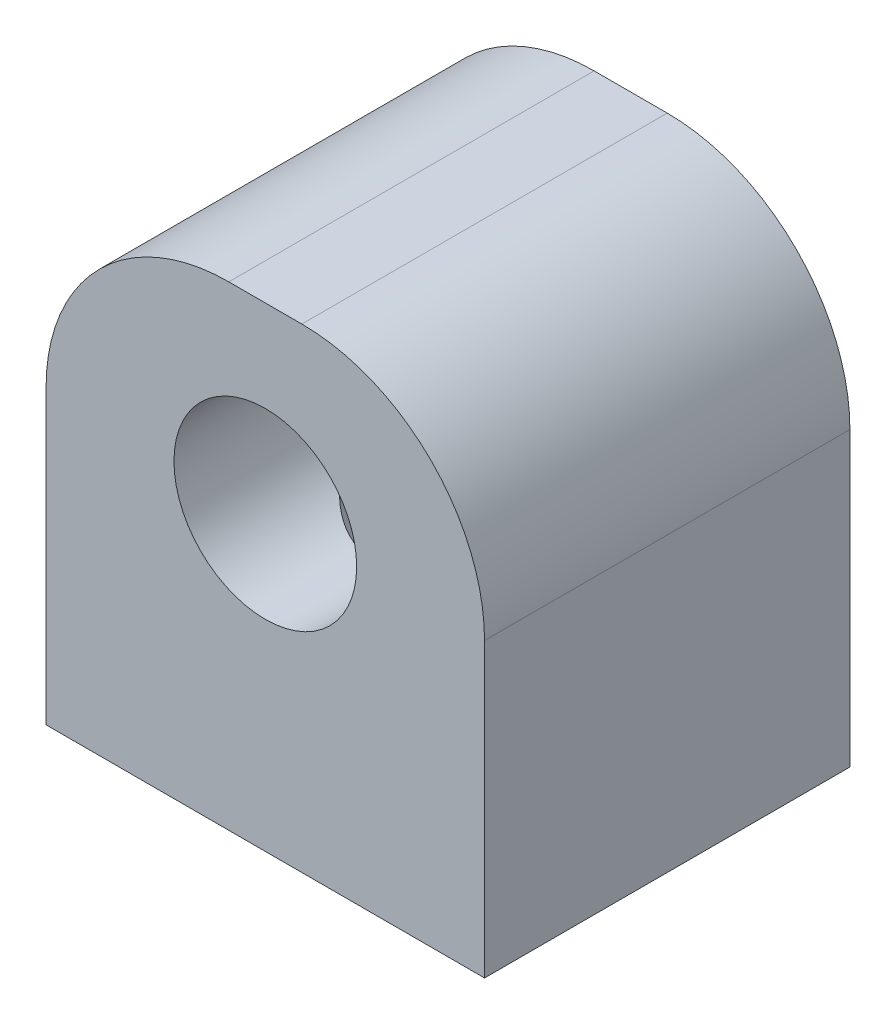
ISO-10303-21;
HEADER;
FILE_DESCRIPTION(('STEP AP214'),'2;1');
FILE_NAME('part.step','',(''),(''),'','','');
FILE_SCHEMA(('AUTOMOTIVE_DESIGN { 1 0 10303 214 1 1 1 1 }'));
ENDSEC;
DATA;
#1=APPLICATION_CONTEXT('core data for automotive mechanical design processes');
#2=APPLICATION_PROTOCOL_DEFINITION('international standard','automotive_design',2000,#1);
#3=PRODUCT_CONTEXT('',#1,'mechanical');
#4=PRODUCT('Part','Part','',(#3));
#5=PRODUCT_RELATED_PRODUCT_CATEGORY('part','',(#4));
#6=PRODUCT_DEFINITION_FORMATION('','',#4);
#7=PRODUCT_DEFINITION_CONTEXT('part definition',#1,'design');
#8=PRODUCT_DEFINITION('design','',#6,#7);
#9=PRODUCT_DEFINITION_SHAPE('','',#8);
#10=(LENGTH_UNIT() NAMED_UNIT(*) SI_UNIT(.MILLI.,.METRE.));
#11=(NAMED_UNIT(*) PLANE_ANGLE_UNIT() SI_UNIT($,.RADIAN.));
#12=(NAMED_UNIT(*) SI_UNIT($,.STERADIAN.) SOLID_ANGLE_UNIT());
#13=UNCERTAINTY_MEASURE_WITH_UNIT(LENGTH_MEASURE(1.E-05),#10,'distance_accuracy_value','');
#14=(GEOMETRIC_REPRESENTATION_CONTEXT(3) GLOBAL_UNCERTAINTY_ASSIGNED_CONTEXT((#13)) GLOBAL_UNIT_ASSIGNED_CONTEXT((#10,
#11,#12)) REPRESENTATION_CONTEXT('',''));
#15=CARTESIAN_POINT('',(0.,0.,0.));
#16=DIRECTION('',(0.,0.,1.));
#17=DIRECTION('',(1.,0.,0.));
#18=AXIS2_PLACEMENT_3D('',#15,#16,#17);
#19=CARTESIAN_POINT('',(6.,-8.,10.));
#20=DIRECTION('',(0.,-1.,0.));
#21=DIRECTION('',(0.,0.,-1.));
#22=AXIS2_PLACEMENT_3D('',#19,#20,#21);
#23=PLANE('',#22);
#24=CARTESIAN_POINT('',(0.,-8.,5.));
#25=DIRECTION('',(0.,-1.,0.));
#26=DIRECTION('',(0.,0.,-1.));
#27=AXIS2_PLACEMENT_3D('',#24,#25,#26);
#28=CIRCLE('',#27,2.1);
#29=CARTESIAN_POINT('',(0.,-8.,2.9));
#30=VERTEX_POINT('',#29);
#31=EDGE_CURVE('E184',#30,#30,#28,.T.);
#32=ORIENTED_EDGE('',*,*,#31,.F.);
#33=EDGE_LOOP('',(#32));
#34=FACE_BOUND('',#33,.T.);
#35=DIRECTION('',(-1.,0.,0.));
#36=VECTOR('',#35,1.);
#37=CARTESIAN_POINT('',(6.,-8.,0.));
#38=LINE('',#37,#36);
#39=CARTESIAN_POINT('',(6.,-8.,0.));
#40=VERTEX_POINT('',#39);
#41=CARTESIAN_POINT('',(-6.,-8.,0.));
#42=VERTEX_POINT('',#41);
#43=EDGE_CURVE('E119',#40,#42,#38,.T.);
#44=ORIENTED_EDGE('',*,*,#43,.F.);
#45=DIRECTION('',(0.,0.,-1.));
#46=VECTOR('',#45,1.);
#47=CARTESIAN_POINT('',(6.,-8.,10.));
#48=LINE('',#47,#46);
#49=CARTESIAN_POINT('',(6.,-8.,10.));
#50=VERTEX_POINT('',#49);
#51=EDGE_CURVE('E98',#50,#40,#48,.T.);
#52=ORIENTED_EDGE('',*,*,#51,.F.);
#53=DIRECTION('',(-1.,0.,0.));
#54=VECTOR('',#53,1.);
#55=CARTESIAN_POINT('',(6.,-8.,10.));
#56=LINE('',#55,#54);
#57=CARTESIAN_POINT('',(-6.,-8.,10.));
#58=VERTEX_POINT('',#57);
#59=EDGE_CURVE('E103',#50,#58,#56,.T.);
#60=ORIENTED_EDGE('',*,*,#59,.T.);
#61=DIRECTION('',(0.,0.,-1.));
#62=VECTOR('',#61,1.);
#63=CARTESIAN_POINT('',(-6.,-8.,10.));
#64=LINE('',#63,#62);
#65=EDGE_CURVE('E86',#58,#42,#64,.T.);
#66=ORIENTED_EDGE('',*,*,#65,.T.);
#67=EDGE_LOOP('',(#44,#52,#60,#66));
#68=FACE_BOUND('',#67,.T.);
#69=ADVANCED_FACE('F33',(#34,#68),#23,.T.);
#70=CARTESIAN_POINT('',(6.,5.,10.));
#71=DIRECTION('',(1.,0.,0.));
#72=DIRECTION('',(0.,0.,-1.));
#73=AXIS2_PLACEMENT_3D('',#70,#71,#72);
#74=PLANE('',#73);
#75=DIRECTION('',(0.,-1.,0.));
#76=VECTOR('',#75,1.);
#77=CARTESIAN_POINT('',(6.,5.,0.));
#78=LINE('',#77,#76);
#79=CARTESIAN_POINT('',(6.,0.,0.));
#80=VERTEX_POINT('',#79);
#81=EDGE_CURVE('E109',#80,#40,#78,.T.);
#82=ORIENTED_EDGE('',*,*,#81,.F.);
#83=DIRECTION('',(0.,0.,-1.));
#84=VECTOR('',#83,1.);
#85=CARTESIAN_POINT('',(6.,0.,10.));
#86=LINE('',#85,#84);
#87=CARTESIAN_POINT('',(6.,0.,10.));
#88=VERTEX_POINT('',#87);
#89=EDGE_CURVE('E11',#80,#88,#86,.F.);
#90=ORIENTED_EDGE('',*,*,#89,.T.);
#91=DIRECTION('',(0.,-1.,0.));
#92=VECTOR('',#91,1.);
#93=CARTESIAN_POINT('',(6.,5.,10.));
#94=LINE('',#93,#92);
#95=EDGE_CURVE('E99',#88,#50,#94,.T.);
#96=ORIENTED_EDGE('',*,*,#95,.T.);
#97=ORIENTED_EDGE('',*,*,#51,.T.);
#98=EDGE_LOOP('',(#82,#90,#96,#97));
#99=FACE_BOUND('',#98,.T.);
#100=ADVANCED_FACE('F145',(#99),#74,.T.);
#101=CARTESIAN_POINT('',(-6.,5.,10.));
#102=DIRECTION('',(0.,1.,0.));
#103=DIRECTION('',(0.,0.,1.));
#104=AXIS2_PLACEMENT_3D('',#101,#102,#103);
#105=PLANE('',#104);
#106=DIRECTION('',(1.,0.,0.));
#107=VECTOR('',#106,1.);
#108=CARTESIAN_POINT('',(-6.,5.,0.));
#109=LINE('',#108,#107);
#110=CARTESIAN_POINT('',(-1.,5.,0.));
#111=VERTEX_POINT('',#110);
#112=CARTESIAN_POINT('',(1.,5.,0.));
#113=VERTEX_POINT('',#112);
#114=EDGE_CURVE('E111',#111,#113,#109,.T.);
#115=ORIENTED_EDGE('',*,*,#114,.F.);
#116=DIRECTION('',(0.,0.,-1.));
#117=VECTOR('',#116,1.);
#118=CARTESIAN_POINT('',(-1.,5.,10.));
#119=LINE('',#118,#117);
#120=CARTESIAN_POINT('',(-1.,5.,10.));
#121=VERTEX_POINT('',#120);
#122=EDGE_CURVE('E134',#111,#121,#119,.F.);
#123=ORIENTED_EDGE('',*,*,#122,.T.);
#124=DIRECTION('',(1.,0.,0.));
#125=VECTOR('',#124,1.);
#126=CARTESIAN_POINT('',(-6.,5.,10.));
#127=LINE('',#126,#125);
#128=CARTESIAN_POINT('',(1.,5.,10.));
#129=VERTEX_POINT('',#128);
#130=EDGE_CURVE('E105',#121,#129,#127,.T.);
#131=ORIENTED_EDGE('',*,*,#130,.T.);
#132=DIRECTION('',(0.,0.,-1.));
#133=VECTOR('',#132,1.);
#134=CARTESIAN_POINT('',(1.,5.,10.));
#135=LINE('',#134,#133);
#136=EDGE_CURVE('E131',#129,#113,#135,.T.);
#137=ORIENTED_EDGE('',*,*,#136,.T.);
#138=EDGE_LOOP('',(#115,#123,#131,#137));
#139=FACE_BOUND('',#138,.T.);
#140=ADVANCED_FACE('F139',(#139),#105,.T.);
#141=CARTESIAN_POINT('',(-6.,-8.,10.));
#142=DIRECTION('',(-1.,0.,0.));
#143=DIRECTION('',(0.,0.,1.));
#144=AXIS2_PLACEMENT_3D('',#141,#142,#143);
#145=PLANE('',#144);
#146=DIRECTION('',(0.,1.,0.));
#147=VECTOR('',#146,1.);
#148=CARTESIAN_POINT('',(-6.,-8.,10.));
#149=LINE('',#148,#147);
#150=CARTESIAN_POINT('',(-6.,0.,10.));
#151=VERTEX_POINT('',#150);
#152=EDGE_CURVE('E90',#58,#151,#149,.T.);
#153=ORIENTED_EDGE('',*,*,#152,.T.);
#154=DIRECTION('',(0.,0.,-1.));
#155=VECTOR('',#154,1.);
#156=CARTESIAN_POINT('',(-6.,0.,10.));
#157=LINE('',#156,#155);
#158=CARTESIAN_POINT('',(-6.,0.,0.));
#159=VERTEX_POINT('',#158);
#160=EDGE_CURVE('E124',#151,#159,#157,.T.);
#161=ORIENTED_EDGE('',*,*,#160,.T.);
#162=DIRECTION('',(0.,1.,0.));
#163=VECTOR('',#162,1.);
#164=CARTESIAN_POINT('',(-6.,-8.,0.));
#165=LINE('',#164,#163);
#166=EDGE_CURVE('E93',#42,#159,#165,.T.);
#167=ORIENTED_EDGE('',*,*,#166,.F.);
#168=ORIENTED_EDGE('',*,*,#65,.F.);
#169=EDGE_LOOP('',(#153,#161,#167,#168));
#170=FACE_BOUND('',#169,.T.);
#171=ADVANCED_FACE('F88',(#170),#145,.T.);
#172=CARTESIAN_POINT('',(0.,0.,10.));
#173=DIRECTION('',(0.,0.,-1.));
#174=DIRECTION('',(-1.,0.,0.));
#175=AXIS2_PLACEMENT_3D('',#172,#173,#174);
#176=PLANE('',#175);
#177=CARTESIAN_POINT('',(0.,0.,10.));
#178=DIRECTION('',(0.,0.,1.));
#179=DIRECTION('',(1.,0.,0.));
#180=AXIS2_PLACEMENT_3D('',#177,#178,#179);
#181=CIRCLE('',#180,2.5);
#182=CARTESIAN_POINT('',(2.5,0.,10.));
#183=VERTEX_POINT('',#182);
#184=EDGE_CURVE('E183',#183,#183,#181,.T.);
#185=ORIENTED_EDGE('',*,*,#184,.F.);
#186=EDGE_LOOP('',(#185));
#187=FACE_BOUND('',#186,.T.);
#188=ORIENTED_EDGE('',*,*,#130,.F.);
#189=CARTESIAN_POINT('',(-1.,0.,10.));
#190=DIRECTION('',(0.,0.,-1.));
#191=DIRECTION('',(-1.,0.,0.));
#192=AXIS2_PLACEMENT_3D('',#189,#190,#191);
#193=CIRCLE('',#192,5.);
#194=EDGE_CURVE('E41',#121,#151,#193,.F.);
#195=ORIENTED_EDGE('',*,*,#194,.T.);
#196=ORIENTED_EDGE('',*,*,#152,.F.);
#197=ORIENTED_EDGE('',*,*,#59,.F.);
#198=ORIENTED_EDGE('',*,*,#95,.F.);
#199=CARTESIAN_POINT('',(1.,0.,10.));
#200=DIRECTION('',(0.,0.,-1.));
#201=DIRECTION('',(-1.,0.,0.));
#202=AXIS2_PLACEMENT_3D('',#199,#200,#201);
#203=CIRCLE('',#202,5.);
#204=EDGE_CURVE('E53',#88,#129,#203,.F.);
#205=ORIENTED_EDGE('',*,*,#204,.T.);
#206=EDGE_LOOP('',(#188,#195,#196,#197,#198,#205));
#207=FACE_BOUND('',#206,.T.);
#208=ADVANCED_FACE('F102',(#187,#207),#176,.F.);
#209=CARTESIAN_POINT('',(0.,0.,0.));
#210=DIRECTION('',(0.,0.,-1.));
#211=DIRECTION('',(-1.,0.,0.));
#212=AXIS2_PLACEMENT_3D('',#209,#210,#211);
#213=PLANE('',#212);
#214=CARTESIAN_POINT('',(0.,0.,0.));
#215=DIRECTION('',(0.,0.,1.));
#216=DIRECTION('',(1.,0.,0.));
#217=AXIS2_PLACEMENT_3D('',#214,#215,#216);
#218=CIRCLE('',#217,2.5);
#219=CARTESIAN_POINT('',(2.5,0.,0.));
#220=VERTEX_POINT('',#219);
#221=EDGE_CURVE('E114',#220,#220,#218,.T.);
#222=ORIENTED_EDGE('',*,*,#221,.T.);
#223=EDGE_LOOP('',(#222));
#224=FACE_BOUND('',#223,.T.);
#225=ORIENTED_EDGE('',*,*,#166,.T.);
#226=CARTESIAN_POINT('',(-1.,0.,0.));
#227=DIRECTION('',(0.,0.,-1.));
#228=DIRECTION('',(-1.,0.,0.));
#229=AXIS2_PLACEMENT_3D('',#226,#227,#228);
#230=CIRCLE('',#229,5.);
#231=EDGE_CURVE('E129',#159,#111,#230,.T.);
#232=ORIENTED_EDGE('',*,*,#231,.T.);
#233=ORIENTED_EDGE('',*,*,#114,.T.);
#234=CARTESIAN_POINT('',(1.,0.,0.));
#235=DIRECTION('',(0.,0.,-1.));
#236=DIRECTION('',(-1.,0.,0.));
#237=AXIS2_PLACEMENT_3D('',#234,#235,#236);
#238=CIRCLE('',#237,5.);
#239=EDGE_CURVE('E127',#113,#80,#238,.T.);
#240=ORIENTED_EDGE('',*,*,#239,.T.);
#241=ORIENTED_EDGE('',*,*,#81,.T.);
#242=ORIENTED_EDGE('',*,*,#43,.T.);
#243=EDGE_LOOP('',(#225,#232,#233,#240,#241,#242));
#244=FACE_BOUND('',#243,.T.);
#245=ADVANCED_FACE('F144',(#224,#244),#213,.T.);
#246=CARTESIAN_POINT('',(0.,0.,0.));
#247=DIRECTION('',(0.,0.,1.));
#248=DIRECTION('',(1.,0.,0.));
#249=AXIS2_PLACEMENT_3D('',#246,#247,#248);
#250=CYLINDRICAL_SURFACE('',#249,2.5);
#251=CARTESIAN_POINT('',(0.,-2.5,7.1));
#252=CARTESIAN_POINT('',(-0.0993730256022461,-2.49999235681323,7.09999218206989));
#253=CARTESIAN_POINT('',(-0.198894461648655,-2.49401423672586,7.09288501982625));
#254=CARTESIAN_POINT('',(-0.394712099458267,-2.47062386361918,7.06495473817506));
#255=CARTESIAN_POINT('',(-0.491000412558241,-2.45318551674386,7.04410031722224));
#256=CARTESIAN_POINT('',(-0.676934489714193,-2.40849407320788,6.99024330228097));
#257=CARTESIAN_POINT('',(-0.766619643075997,-2.38130603299301,6.95732120035384));
#258=CARTESIAN_POINT('',(-0.938364030346451,-2.31901636821694,6.88104181971871));
#259=CARTESIAN_POINT('',(-1.02042318288168,-2.28391465922644,6.83768442967844));
#260=CARTESIAN_POINT('',(-1.20508095932735,-2.19360207513657,6.72437703447379));
#261=CARTESIAN_POINT('',(-1.30400396937415,-2.13576228881416,6.65052906935895));
#262=CARTESIAN_POINT('',(-1.48564887479632,-2.0136759023241,6.48919024514837));
#263=CARTESIAN_POINT('',(-1.56832369757732,-1.9494114777754,6.40166102799467));
#264=CARTESIAN_POINT('',(-1.71877589361501,-1.81821074291079,6.21271884439298));
#265=CARTESIAN_POINT('',(-1.78623999238275,-1.75124686144345,6.11107346397337));
#266=CARTESIAN_POINT('',(-1.87423794813291,-1.65503457960634,5.94919914297048));
#267=CARTESIAN_POINT('',(-1.90135639211036,-1.62369006147129,5.89371583746389));
#268=CARTESIAN_POINT('',(-1.95101171748606,-1.56366934291662,5.7793830682352));
#269=CARTESIAN_POINT('',(-1.97355246264258,-1.53499090340243,5.72053649745956));
#270=CARTESIAN_POINT('',(-2.01536124409853,-1.47973546664873,5.59422401073508));
#271=CARTESIAN_POINT('',(-2.0342028938972,-1.4535299349471,5.52644799639923));
#272=CARTESIAN_POINT('',(-2.06527249369073,-1.40903910635948,5.38695313475467));
#273=CARTESIAN_POINT('',(-2.07751605234462,-1.39073513788832,5.31524403881116));
#274=CARTESIAN_POINT('',(-2.09459755052995,-1.36488977022328,5.16794159064057));
#275=CARTESIAN_POINT('',(-2.09933757951668,-1.35749074972233,5.09230997503387));
#276=CARTESIAN_POINT('',(-2.10053165369518,-1.3556436780245,4.94083251890799));
#277=CARTESIAN_POINT('',(-2.09698775837109,-1.36119240785914,4.8649867363157));
#278=CARTESIAN_POINT('',(-2.08157225094924,-1.38464712394946,4.71114717025584));
#279=CARTESIAN_POINT('',(-2.0691755235948,-1.40333109380419,4.63333302758939));
#280=CARTESIAN_POINT('',(-2.03663853769778,-1.45013886604576,4.48219474403251));
#281=CARTESIAN_POINT('',(-2.01647195943919,-1.4782947120401,4.40888685718315));
#282=CARTESIAN_POINT('',(-1.97403882515765,-1.53432551020142,4.2811360917108));
#283=CARTESIAN_POINT('',(-1.95296589301682,-1.56116602160658,4.22581910705411));
#284=CARTESIAN_POINT('',(-1.90677427610892,-1.6172621810052,4.11815981019018));
#285=CARTESIAN_POINT('',(-1.88165311554882,-1.64651930156357,4.06581934501766));
#286=CARTESIAN_POINT('',(-1.8004572205701,-1.73632877202851,3.91293641434155));
#287=CARTESIAN_POINT('',(-1.73857376837968,-1.79888580247092,3.8166017640812));
#288=CARTESIAN_POINT('',(-1.59579178548324,-1.92697550014963,3.62956765322734));
#289=CARTESIAN_POINT('',(-1.51398796192496,-1.99246641213291,3.53953429800797));
#290=CARTESIAN_POINT('',(-1.33362147394091,-2.11741444234027,3.37321437911367));
#291=CARTESIAN_POINT('',(-1.23509319570342,-2.17688354894804,3.29690025805046));
#292=CARTESIAN_POINT('',(-1.04606866583774,-2.27250261099959,3.17646752478603));
#293=CARTESIAN_POINT('',(-0.958857259834139,-2.31087848129322,3.12897504601199));
#294=CARTESIAN_POINT('',(-0.775629660941304,-2.37863696788946,3.04590336836828));
#295=CARTESIAN_POINT('',(-0.679618471130926,-2.40802465366703,3.01031745294468));
#296=CARTESIAN_POINT('',(-0.479938971914013,-2.45565985501552,2.95292307672678));
#297=CARTESIAN_POINT('',(-0.376214464265066,-2.47381430175865,2.93122966679031));
#298=CARTESIAN_POINT('',(-0.165239035352795,-2.49678205720079,2.90381797362977));
#299=CARTESIAN_POINT('',(-0.0579910743036265,-2.50160628914294,2.89808661051709));
#300=CARTESIAN_POINT('',(0.141982570703226,-2.4977064284626,2.90273147820421));
#301=CARTESIAN_POINT('',(0.234797260987606,-2.49064946589601,2.91112558996009));
#302=CARTESIAN_POINT('',(0.417235152283117,-2.46665360458316,2.93979574937017));
#303=CARTESIAN_POINT('',(0.506858080344446,-2.44971386283451,2.96007281064223));
#304=CARTESIAN_POINT('',(0.680859199372355,-2.40717070379506,3.01136321519744));
#305=CARTESIAN_POINT('',(0.765231733506991,-2.3815581272642,3.04238790968339));
#306=CARTESIAN_POINT('',(0.927287359991361,-2.32326696301429,3.11373655537739));
#307=CARTESIAN_POINT('',(1.00496777424083,-2.29058556464245,3.15406420598375));
#308=CARTESIAN_POINT('',(1.18582278648894,-2.20405034491775,3.26237554045979));
#309=CARTESIAN_POINT('',(1.28500120331795,-2.14723900759012,3.33468809764069));
#310=CARTESIAN_POINT('',(1.46741117070229,-2.02699462521279,3.49289539646658));
#311=CARTESIAN_POINT('',(1.5505969802756,-1.96354336556243,3.57882785053656));
#312=CARTESIAN_POINT('',(1.70228679312989,-1.83365930236987,3.76434086820863));
#313=CARTESIAN_POINT('',(1.77049341616493,-1.7671931544897,3.86414291471128));
#314=CARTESIAN_POINT('',(1.85989841024774,-1.67113985671741,4.02304074332868));
#315=CARTESIAN_POINT('',(1.88753704511957,-1.63974677213347,4.0775051474202));
#316=CARTESIAN_POINT('',(1.93835723718052,-1.57934206807543,4.18971300222849));
#317=CARTESIAN_POINT('',(1.96154209274454,-1.55032869543312,4.24745398500653));
#318=CARTESIAN_POINT('',(2.00546732844908,-1.49316445828114,4.37309476195078));
#319=CARTESIAN_POINT('',(2.02564470128841,-1.46547259201835,4.44140862100762));
#320=CARTESIAN_POINT('',(2.05928882593353,-1.41780992180363,4.58221125500121));
#321=CARTESIAN_POINT('',(2.07277001860966,-1.39782252357172,4.65469066635014));
#322=CARTESIAN_POINT('',(2.09220045313067,-1.36858699102638,4.80399486340785));
#323=CARTESIAN_POINT('',(2.09804139433367,-1.35949342538338,4.88086634012618));
#324=CARTESIAN_POINT('',(2.1011194992483,-1.35473717985816,5.03518243647301));
#325=CARTESIAN_POINT('',(2.09836281059349,-1.35906490322944,5.11262660709165));
#326=CARTESIAN_POINT('',(2.08565152579525,-1.37845870531476,5.25362800434725));
#327=CARTESIAN_POINT('',(2.07682414703655,-1.39183839640923,5.31754241715055));
#328=CARTESIAN_POINT('',(2.05382763816655,-1.42555682918548,5.44253378956341));
#329=CARTESIAN_POINT('',(2.03965016544352,-1.44590643472725,5.50360614950799));
#330=CARTESIAN_POINT('',(1.99332588452215,-1.50969345143492,5.67009294266173));
#331=CARTESIAN_POINT('',(1.95587568242065,-1.55858039005568,5.77191180695535));
#332=CARTESIAN_POINT('',(1.86775331734827,-1.66319886386282,5.965863051601));
#333=CARTESIAN_POINT('',(1.81704180517595,-1.71895050312421,6.05796543999195));
#334=CARTESIAN_POINT('',(1.69917403585597,-1.8358008581679,6.23904881524715));
#335=CARTESIAN_POINT('',(1.63113117269081,-1.8970047055467,6.32738697349872));
#336=CARTESIAN_POINT('',(1.48087039537919,-2.01649069226847,6.49315309908591));
#337=CARTESIAN_POINT('',(1.39867179886949,-2.07477667537387,6.57059567677438));
#338=CARTESIAN_POINT('',(1.22871778675756,-2.17927144644782,6.70613252193995));
#339=CARTESIAN_POINT('',(1.1422696665149,-2.22610312268132,6.76537388274852));
#340=CARTESIAN_POINT('',(0.958257418317822,-2.31127343296888,6.87162845538844));
#341=CARTESIAN_POINT('',(0.86070017120872,-2.34961728140329,6.91864917790969));
#342=CARTESIAN_POINT('',(0.672523474698196,-2.40953347022021,6.99153373036493));
#343=CARTESIAN_POINT('',(0.583294372598298,-2.43280819164692,7.01957966876949));
#344=CARTESIAN_POINT('',(0.400084141601313,-2.46953481506508,7.06367478541061));
#345=CARTESIAN_POINT('',(0.3061158069205,-2.48301179337184,7.07975459224184));
#346=CARTESIAN_POINT('',(0.176152977211528,-2.49403576514249,7.09289668571569));
#347=CARTESIAN_POINT('',(0.14102074194374,-2.49626804937887,7.09555605749173));
#348=CARTESIAN_POINT('',(0.0705986028557338,-2.49925166865651,7.09910927519441));
#349=CARTESIAN_POINT('',(0.0353086697141584,-2.50000271573453,7.10000277782336));
#350=CARTESIAN_POINT('',(0.,-2.5,7.1));
#351=B_SPLINE_CURVE_WITH_KNOTS('',3,(#251,#252,#253,#254,#255,#256,#257,#258,#259,#260,#261,
#262,#263,#264,#265,#266,#267,#268,#269,#270,#271,#272,#273,#274,#275,#276,#277,#278,#279,#280,
#281,#282,#283,#284,#285,#286,#287,#288,#289,#290,#291,#292,#293,#294,#295,#296,#297,#298,#299,
#300,#301,#302,#303,#304,#305,#306,#307,#308,#309,#310,#311,#312,#313,#314,#315,#316,#317,#318,
#319,#320,#321,#322,#323,#324,#325,#326,#327,#328,#329,#330,#331,#332,#333,#334,#335,#336,#337,
#338,#339,#340,#341,#342,#343,#344,#345,#346,#347,#348,#349,#350),.UNSPECIFIED.,.T.,.F.,(4,2,2,
2,2,2,2,2,2,2,2,2,2,2,2,2,2,2,2,2,2,2,2,2,2,2,2,2,2,2,2,2,2,2,2,2,2,2,2,2,2,2,2,2,2,2,2,2,2,4),
(0.,0.297962620674466,0.596606035663124,0.893292691432596,1.18998251264047,1.59675200685626,
2.00468312125291,2.42037345900016,2.62792558018693,2.83530178438657,3.05987449559393,
3.28391359186869,3.51085267450524,3.73773534333245,3.9793303945996,4.22175112797397,
4.41648056644972,4.61132955161957,5.00126650512848,5.41417045982349,5.82623552767469,
6.14441396184944,6.46241260611802,6.78301181803362,7.10334824175016,7.38236969632225,
7.66141495494251,7.94075583262647,8.22020798461904,8.62374969606758,9.02842895783349,
9.4405331385982,9.64634836985898,9.85201058606808,10.0806637317801,10.3088216034389,
10.5401797720754,10.7713725487261,10.9683042381135,11.1655442883211,11.5205132267229,
11.8765476282863,12.2568989386321,12.6367352566501,12.9798180218012,13.3226894301976,
13.610660066359,13.8978910513837,14.0037408934564,14.1096113114778),.UNSPECIFIED.);
#352=CARTESIAN_POINT('',(0.,-2.5,7.1));
#353=VERTEX_POINT('',#352);
#354=EDGE_CURVE('E178',#353,#353,#351,.T.);
#355=ORIENTED_EDGE('',*,*,#354,.T.);
#356=EDGE_LOOP('',(#355));
#357=FACE_BOUND('',#356,.T.);
#358=ORIENTED_EDGE('',*,*,#221,.F.);
#359=EDGE_LOOP('',(#358));
#360=FACE_BOUND('',#359,.T.);
#361=ORIENTED_EDGE('',*,*,#184,.T.);
#362=EDGE_LOOP('',(#361));
#363=FACE_BOUND('',#362,.T.);
#364=ADVANCED_FACE('F167',(#357,#360,#363),#250,.F.);
#365=CARTESIAN_POINT('',(0.,0.,5.));
#366=DIRECTION('',(0.,1.,0.));
#367=DIRECTION('',(0.,0.,1.));
#368=AXIS2_PLACEMENT_3D('',#365,#366,#367);
#369=CYLINDRICAL_SURFACE('',#368,2.1);
#370=ORIENTED_EDGE('',*,*,#31,.T.);
#371=EDGE_LOOP('',(#370));
#372=FACE_BOUND('',#371,.T.);
#373=ORIENTED_EDGE('',*,*,#354,.F.);
#374=EDGE_LOOP('',(#373));
#375=FACE_BOUND('',#374,.T.);
#376=ADVANCED_FACE('F151',(#372,#375),#369,.F.);
#377=CARTESIAN_POINT('',(-1.,0.,10.));
#378=DIRECTION('',(0.,0.,-1.));
#379=DIRECTION('',(-1.,0.,0.));
#380=AXIS2_PLACEMENT_3D('',#377,#378,#379);
#381=CYLINDRICAL_SURFACE('',#380,5.);
#382=ORIENTED_EDGE('',*,*,#194,.F.);
#383=ORIENTED_EDGE('',*,*,#122,.F.);
#384=ORIENTED_EDGE('',*,*,#231,.F.);
#385=ORIENTED_EDGE('',*,*,#160,.F.);
#386=EDGE_LOOP('',(#382,#383,#384,#385));
#387=FACE_BOUND('',#386,.T.);
#388=ADVANCED_FACE('F142',(#387),#381,.T.);
#389=CARTESIAN_POINT('',(1.,0.,10.));
#390=DIRECTION('',(0.,0.,-1.));
#391=DIRECTION('',(-1.,0.,0.));
#392=AXIS2_PLACEMENT_3D('',#389,#390,#391);
#393=CYLINDRICAL_SURFACE('',#392,5.);
#394=ORIENTED_EDGE('',*,*,#204,.F.);
#395=ORIENTED_EDGE('',*,*,#89,.F.);
#396=ORIENTED_EDGE('',*,*,#239,.F.);
#397=ORIENTED_EDGE('',*,*,#136,.F.);
#398=EDGE_LOOP('',(#394,#395,#396,#397));
#399=FACE_BOUND('',#398,.T.);
#400=ADVANCED_FACE('F35',(#399),#393,.T.);
#401=CLOSED_SHELL('',(#69,#100,#140,#171,#208,#245,#364,#376,#388,#400));
#402=MANIFOLD_SOLID_BREP('B2',#401);
#403=ADVANCED_BREP_SHAPE_REPRESENTATION('',(#18,#402),#14);
#404=SHAPE_DEFINITION_REPRESENTATION(#9,#403);
ENDSEC;
END-ISO-10303-21;
